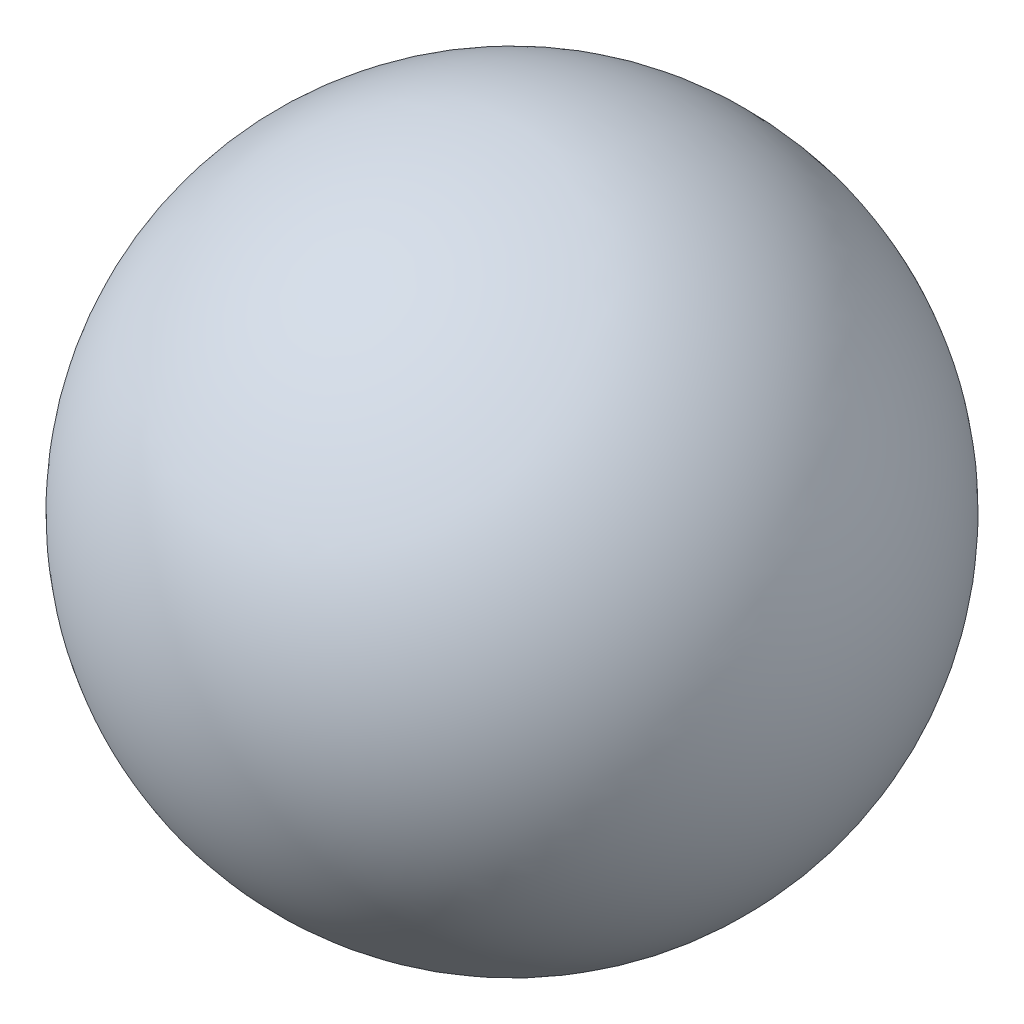
ISO-10303-21;
HEADER;
FILE_DESCRIPTION(('STEP AP214'),'2;1');
FILE_NAME('part.step','',(''),(''),'','','');
FILE_SCHEMA(('AUTOMOTIVE_DESIGN { 1 0 10303 214 1 1 1 1 }'));
ENDSEC;
DATA;
#1=APPLICATION_CONTEXT('core data for automotive mechanical design processes');
#2=APPLICATION_PROTOCOL_DEFINITION('international standard','automotive_design',2000,#1);
#3=PRODUCT_CONTEXT('',#1,'mechanical');
#4=PRODUCT('Part','Part','',(#3));
#5=PRODUCT_RELATED_PRODUCT_CATEGORY('part','',(#4));
#6=PRODUCT_DEFINITION_FORMATION('','',#4);
#7=PRODUCT_DEFINITION_CONTEXT('part definition',#1,'design');
#8=PRODUCT_DEFINITION('design','',#6,#7);
#9=PRODUCT_DEFINITION_SHAPE('','',#8);
#10=(LENGTH_UNIT() NAMED_UNIT(*) SI_UNIT(.MILLI.,.METRE.));
#11=(NAMED_UNIT(*) PLANE_ANGLE_UNIT() SI_UNIT($,.RADIAN.));
#12=(NAMED_UNIT(*) SI_UNIT($,.STERADIAN.) SOLID_ANGLE_UNIT());
#13=UNCERTAINTY_MEASURE_WITH_UNIT(LENGTH_MEASURE(1.E-05),#10,'distance_accuracy_value','');
#14=(GEOMETRIC_REPRESENTATION_CONTEXT(3) GLOBAL_UNCERTAINTY_ASSIGNED_CONTEXT((#13)) GLOBAL_UNIT_ASSIGNED_CONTEXT((#10,
#11,#12)) REPRESENTATION_CONTEXT('',''));
#15=CARTESIAN_POINT('',(0.,0.,0.));
#16=DIRECTION('',(0.,0.,1.));
#17=DIRECTION('',(1.,0.,0.));
#18=AXIS2_PLACEMENT_3D('',#15,#16,#17);
#19=CARTESIAN_POINT('',(64.16,0.605473212483679,-69.3803581079614));
#20=DIRECTION('',(0.,0.00872653549837383,-0.999961923064171));
#21=DIRECTION('',(0.173648177666934,0.984770254550592,0.0085939598157348));
#22=AXIS2_PLACEMENT_3D('',#19,#20,#21);
#23=SPHERICAL_SURFACE('',#22,7.15);
#24=CARTESIAN_POINT('',(64.16,0.543078483670306,-62.2306303580526));
#25=VERTEX_POINT('',#24);
#26=VERTEX_LOOP('',#25);
#27=FACE_BOUND('',#26,.T.);
#28=CARTESIAN_POINT('',(64.16,0.667867941297053,-76.5300858578702));
#29=VERTEX_POINT('',#28);
#30=VERTEX_LOOP('',#29);
#31=FACE_BOUND('',#30,.T.);
#32=ADVANCED_FACE('F15',(#27,#31),#23,.T.);
#33=CLOSED_SHELL('',(#32));
#34=MANIFOLD_SOLID_BREP('B1',#33);
#35=ADVANCED_BREP_SHAPE_REPRESENTATION('',(#18,#34),#14);
#36=SHAPE_DEFINITION_REPRESENTATION(#9,#35);
ENDSEC;
END-ISO-10303-21;
